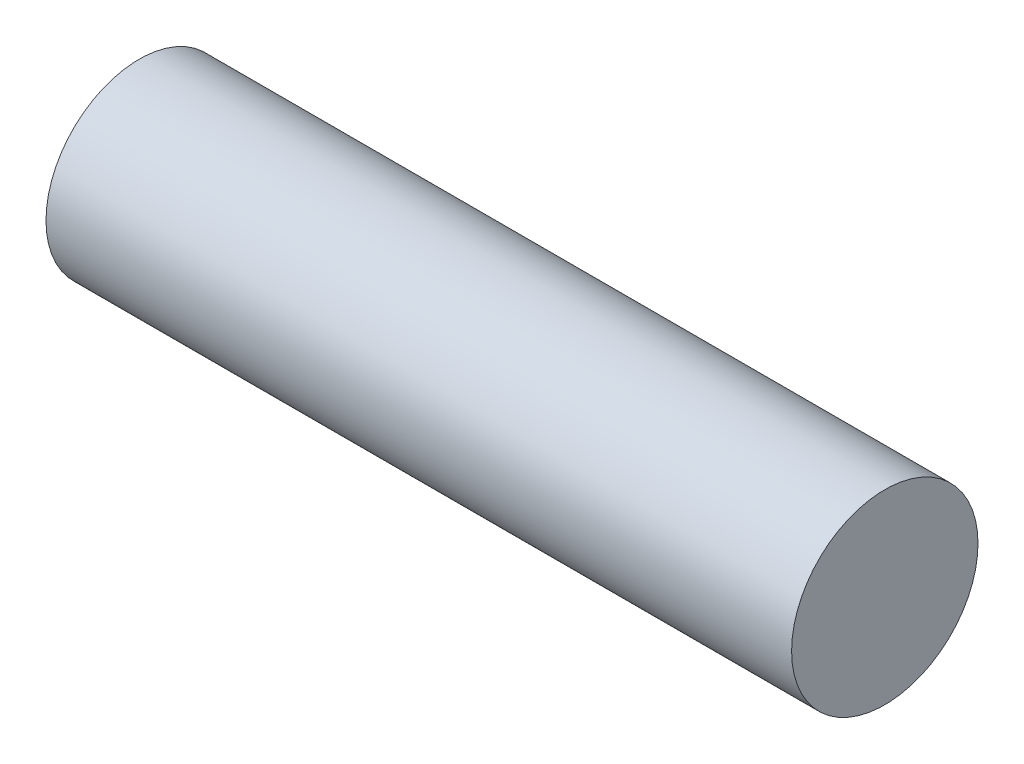
ISO-10303-21;
HEADER;
FILE_DESCRIPTION(('STEP AP214'),'2;1');
FILE_NAME('part.step','',(''),(''),'','','');
FILE_SCHEMA(('AUTOMOTIVE_DESIGN { 1 0 10303 214 1 1 1 1 }'));
ENDSEC;
DATA;
#1=APPLICATION_CONTEXT('core data for automotive mechanical design processes');
#2=APPLICATION_PROTOCOL_DEFINITION('international standard','automotive_design',2000,#1);
#3=PRODUCT_CONTEXT('',#1,'mechanical');
#4=PRODUCT('Part','Part','',(#3));
#5=PRODUCT_RELATED_PRODUCT_CATEGORY('part','',(#4));
#6=PRODUCT_DEFINITION_FORMATION('','',#4);
#7=PRODUCT_DEFINITION_CONTEXT('part definition',#1,'design');
#8=PRODUCT_DEFINITION('design','',#6,#7);
#9=PRODUCT_DEFINITION_SHAPE('','',#8);
#10=(LENGTH_UNIT() NAMED_UNIT(*) SI_UNIT(.MILLI.,.METRE.));
#11=(NAMED_UNIT(*) PLANE_ANGLE_UNIT() SI_UNIT($,.RADIAN.));
#12=(NAMED_UNIT(*) SI_UNIT($,.STERADIAN.) SOLID_ANGLE_UNIT());
#13=UNCERTAINTY_MEASURE_WITH_UNIT(LENGTH_MEASURE(1.E-05),#10,'distance_accuracy_value','');
#14=(GEOMETRIC_REPRESENTATION_CONTEXT(3) GLOBAL_UNCERTAINTY_ASSIGNED_CONTEXT((#13)) GLOBAL_UNIT_ASSIGNED_CONTEXT((#10,
#11,#12)) REPRESENTATION_CONTEXT('',''));
#15=CARTESIAN_POINT('',(0.,0.,0.));
#16=DIRECTION('',(0.,0.,1.));
#17=DIRECTION('',(1.,0.,0.));
#18=AXIS2_PLACEMENT_3D('',#15,#16,#17);
#19=CARTESIAN_POINT('',(50.8,0.,0.));
#20=DIRECTION('',(-1.,0.,0.));
#21=DIRECTION('',(0.,0.,1.));
#22=AXIS2_PLACEMENT_3D('',#19,#20,#21);
#23=CYLINDRICAL_SURFACE('',#22,6.35);
#24=CARTESIAN_POINT('',(50.8,0.,0.));
#25=DIRECTION('',(1.,0.,0.));
#26=DIRECTION('',(0.,0.,-1.));
#27=AXIS2_PLACEMENT_3D('',#24,#25,#26);
#28=CIRCLE('',#27,6.35);
#29=CARTESIAN_POINT('',(50.8,0.,-6.35));
#30=VERTEX_POINT('',#29);
#31=EDGE_CURVE('E10',#30,#30,#28,.T.);
#32=ORIENTED_EDGE('',*,*,#31,.F.);
#33=EDGE_LOOP('',(#32));
#34=FACE_BOUND('',#33,.T.);
#35=CARTESIAN_POINT('',(0.,0.,0.));
#36=DIRECTION('',(1.,0.,0.));
#37=DIRECTION('',(0.,0.,-1.));
#38=AXIS2_PLACEMENT_3D('',#35,#36,#37);
#39=CIRCLE('',#38,6.35);
#40=CARTESIAN_POINT('',(0.,0.,-6.35));
#41=VERTEX_POINT('',#40);
#42=EDGE_CURVE('E42',#41,#41,#39,.T.);
#43=ORIENTED_EDGE('',*,*,#42,.T.);
#44=EDGE_LOOP('',(#43));
#45=FACE_BOUND('',#44,.T.);
#46=ADVANCED_FACE('F39',(#34,#45),#23,.T.);
#47=CARTESIAN_POINT('',(50.8,0.,0.));
#48=DIRECTION('',(1.,0.,0.));
#49=DIRECTION('',(0.,0.,-1.));
#50=AXIS2_PLACEMENT_3D('',#47,#48,#49);
#51=PLANE('',#50);
#52=ORIENTED_EDGE('',*,*,#31,.T.);
#53=EDGE_LOOP('',(#52));
#54=FACE_BOUND('',#53,.T.);
#55=ADVANCED_FACE('F54',(#54),#51,.T.);
#56=CARTESIAN_POINT('',(0.,0.,0.));
#57=DIRECTION('',(1.,0.,0.));
#58=DIRECTION('',(0.,0.,-1.));
#59=AXIS2_PLACEMENT_3D('',#56,#57,#58);
#60=PLANE('',#59);
#61=ORIENTED_EDGE('',*,*,#42,.F.);
#62=EDGE_LOOP('',(#61));
#63=FACE_BOUND('',#62,.T.);
#64=ADVANCED_FACE('F52',(#63),#60,.F.);
#65=CLOSED_SHELL('',(#46,#55,#64));
#66=MANIFOLD_SOLID_BREP('B2',#65);
#67=ADVANCED_BREP_SHAPE_REPRESENTATION('',(#18,#66),#14);
#68=SHAPE_DEFINITION_REPRESENTATION(#9,#67);
ENDSEC;
END-ISO-10303-21;
